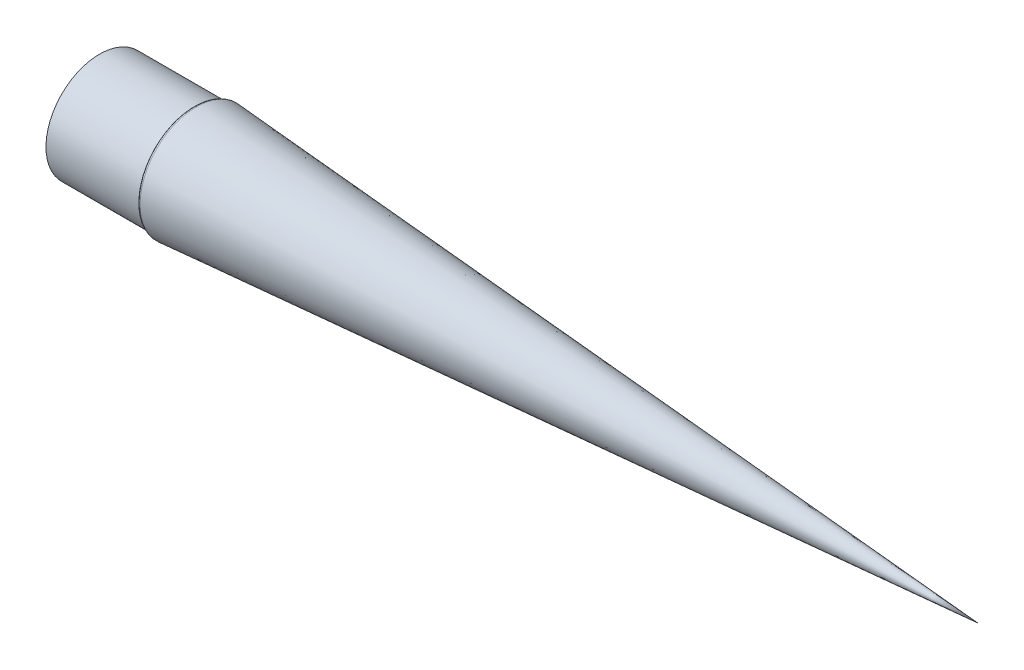
ISO-10303-21;
HEADER;
FILE_DESCRIPTION(('STEP AP214'),'2;1');
FILE_NAME('part.step','',(''),(''),'','','');
FILE_SCHEMA(('AUTOMOTIVE_DESIGN { 1 0 10303 214 1 1 1 1 }'));
ENDSEC;
DATA;
#1=APPLICATION_CONTEXT('core data for automotive mechanical design processes');
#2=APPLICATION_PROTOCOL_DEFINITION('international standard','automotive_design',2000,#1);
#3=PRODUCT_CONTEXT('',#1,'mechanical');
#4=PRODUCT('Part','Part','',(#3));
#5=PRODUCT_RELATED_PRODUCT_CATEGORY('part','',(#4));
#6=PRODUCT_DEFINITION_FORMATION('','',#4);
#7=PRODUCT_DEFINITION_CONTEXT('part definition',#1,'design');
#8=PRODUCT_DEFINITION('design','',#6,#7);
#9=PRODUCT_DEFINITION_SHAPE('','',#8);
#10=(LENGTH_UNIT() NAMED_UNIT(*) SI_UNIT(.MILLI.,.METRE.));
#11=(NAMED_UNIT(*) PLANE_ANGLE_UNIT() SI_UNIT($,.RADIAN.));
#12=(NAMED_UNIT(*) SI_UNIT($,.STERADIAN.) SOLID_ANGLE_UNIT());
#13=UNCERTAINTY_MEASURE_WITH_UNIT(LENGTH_MEASURE(1.E-05),#10,'distance_accuracy_value','');
#14=(GEOMETRIC_REPRESENTATION_CONTEXT(3) GLOBAL_UNCERTAINTY_ASSIGNED_CONTEXT((#13)) GLOBAL_UNIT_ASSIGNED_CONTEXT((#10,
#11,#12)) REPRESENTATION_CONTEXT('',''));
#15=CARTESIAN_POINT('',(0.,0.,0.));
#16=DIRECTION('',(0.,0.,1.));
#17=DIRECTION('',(1.,0.,0.));
#18=AXIS2_PLACEMENT_3D('',#15,#16,#17);
#19=CARTESIAN_POINT('',(-26.7776403853178,13.74,0.));
#20=DIRECTION('',(1.,0.,0.));
#21=DIRECTION('',(0.,1.,0.));
#22=AXIS2_PLACEMENT_3D('',#19,#20,#21);
#23=PLANE('',#22);
#24=CARTESIAN_POINT('',(-26.7776403853178,0.,0.));
#25=DIRECTION('',(-1.,0.,0.));
#26=DIRECTION('',(0.,-1.,0.));
#27=AXIS2_PLACEMENT_3D('',#24,#25,#26);
#28=CIRCLE('',#27,13.74);
#29=CARTESIAN_POINT('',(-26.7776403853178,-13.74,0.));
#30=VERTEX_POINT('',#29);
#31=EDGE_CURVE('E11',#30,#30,#28,.T.);
#32=ORIENTED_EDGE('',*,*,#31,.F.);
#33=EDGE_LOOP('',(#32));
#34=FACE_BOUND('',#33,.T.);
#35=CARTESIAN_POINT('',(-26.7776403853178,0.,0.));
#36=DIRECTION('',(-1.,0.,0.));
#37=DIRECTION('',(0.,-1.,0.));
#38=AXIS2_PLACEMENT_3D('',#35,#36,#37);
#39=CIRCLE('',#38,14.5);
#40=CARTESIAN_POINT('',(-26.7776403853178,-14.5,0.));
#41=VERTEX_POINT('',#40);
#42=EDGE_CURVE('E79',#41,#41,#39,.T.);
#43=ORIENTED_EDGE('',*,*,#42,.T.);
#44=EDGE_LOOP('',(#43));
#45=FACE_BOUND('',#44,.T.);
#46=ADVANCED_FACE('F33',(#34,#45),#23,.F.);
#47=CARTESIAN_POINT('',(0.,0.,0.));
#48=DIRECTION('',(-1.,0.,0.));
#49=DIRECTION('',(0.,-1.,0.));
#50=AXIS2_PLACEMENT_3D('',#47,#48,#49);
#51=CYLINDRICAL_SURFACE('',#50,13.74);
#52=CARTESIAN_POINT('',(-1.37764038531785,0.,0.));
#53=DIRECTION('',(-1.,0.,0.));
#54=DIRECTION('',(0.,-1.,0.));
#55=AXIS2_PLACEMENT_3D('',#52,#53,#54);
#56=CIRCLE('',#55,13.74);
#57=CARTESIAN_POINT('',(-1.37764038531784,-13.74,0.));
#58=VERTEX_POINT('',#57);
#59=EDGE_CURVE('E40',#58,#58,#56,.T.);
#60=ORIENTED_EDGE('',*,*,#59,.F.);
#61=EDGE_LOOP('',(#60));
#62=FACE_BOUND('',#61,.T.);
#63=ORIENTED_EDGE('',*,*,#31,.T.);
#64=EDGE_LOOP('',(#63));
#65=FACE_BOUND('',#64,.T.);
#66=ADVANCED_FACE('F70',(#62,#65),#51,.F.);
#67=CARTESIAN_POINT('',(-1.37764038531785,0.,0.));
#68=DIRECTION('',(-1.,0.,0.));
#69=DIRECTION('',(0.,-1.,0.));
#70=AXIS2_PLACEMENT_3D('',#67,#68,#69);
#71=TOROIDAL_SURFACE('',#70,14.5,0.76);
#72=CARTESIAN_POINT('',(-0.618623339422718,0.,0.));
#73=DIRECTION('',(-1.,0.,0.));
#74=DIRECTION('',(0.,-1.,0.));
#75=AXIS2_PLACEMENT_3D('',#72,#73,#74);
#76=CIRCLE('',#75,14.4613590367533);
#77=CARTESIAN_POINT('',(-0.618623339422717,-14.4613590367533,0.));
#78=VERTEX_POINT('',#77);
#79=EDGE_CURVE('E56',#78,#78,#76,.T.);
#80=ORIENTED_EDGE('',*,*,#79,.F.);
#81=EDGE_LOOP('',(#80));
#82=FACE_BOUND('',#81,.T.);
#83=ORIENTED_EDGE('',*,*,#59,.T.);
#84=EDGE_LOOP('',(#83));
#85=FACE_BOUND('',#84,.T.);
#86=ADVANCED_FACE('F68',(#82,#85),#71,.T.);
#87=CARTESIAN_POINT('',(-0.572578341392468,0.,0.));
#88=DIRECTION('',(-1.,0.,0.));
#89=DIRECTION('',(0.,-1.,0.));
#90=AXIS2_PLACEMENT_3D('',#87,#88,#89);
#91=TOROIDAL_SURFACE('',#90,14.459014921972,0.0461046279424731);
#92=CARTESIAN_POINT('',(-0.56926031238832,0.,0.));
#93=DIRECTION('',(-1.,0.,0.));
#94=DIRECTION('',(0.,-1.,0.));
#95=AXIS2_PLACEMENT_3D('',#92,#93,#94);
#96=CIRCLE('',#95,14.505);
#97=CARTESIAN_POINT('',(-0.569260312388319,-14.505,0.));
#98=VERTEX_POINT('',#97);
#99=EDGE_CURVE('E54',#98,#98,#96,.T.);
#100=ORIENTED_EDGE('',*,*,#99,.F.);
#101=EDGE_LOOP('',(#100));
#102=FACE_BOUND('',#101,.T.);
#103=ORIENTED_EDGE('',*,*,#79,.T.);
#104=EDGE_LOOP('',(#103));
#105=FACE_BOUND('',#104,.T.);
#106=ADVANCED_FACE('F50',(#102,#105),#91,.F.);
#107=CARTESIAN_POINT('',(-0.56926031238832,0.,0.));
#108=DIRECTION('',(-1.,0.,0.));
#109=DIRECTION('',(0.,-1.,0.));
#110=AXIS2_PLACEMENT_3D('',#107,#108,#109);
#111=CONICAL_SURFACE('',#110,14.505,0.0720296427488585);
#112=CARTESIAN_POINT('',(200.457781941133,0.,0.));
#113=VERTEX_POINT('',#112);
#114=VERTEX_LOOP('',#113);
#115=FACE_BOUND('',#114,.T.);
#116=ORIENTED_EDGE('',*,*,#99,.T.);
#117=EDGE_LOOP('',(#116));
#118=FACE_BOUND('',#117,.T.);
#119=ADVANCED_FACE('F46',(#115,#118),#111,.F.);
#120=CARTESIAN_POINT('',(211.018122792124,0.,0.));
#121=DIRECTION('',(-1.,0.,0.));
#122=DIRECTION('',(0.,-1.,0.));
#123=AXIS2_PLACEMENT_3D('',#120,#121,#122);
#124=CONICAL_SURFACE('',#123,0.,0.0720296427488585);
#125=CARTESIAN_POINT('',(-0.541877207875957,0.,0.));
#126=DIRECTION('',(-1.,0.,0.));
#127=DIRECTION('',(0.,-1.,0.));
#128=AXIS2_PLACEMENT_3D('',#125,#126,#127);
#129=CIRCLE('',#128,15.265);
#130=CARTESIAN_POINT('',(-0.541877207875956,-15.265,0.));
#131=VERTEX_POINT('',#130);
#132=EDGE_CURVE('E57',#131,#131,#129,.T.);
#133=ORIENTED_EDGE('',*,*,#132,.F.);
#134=EDGE_LOOP('',(#133));
#135=FACE_BOUND('',#134,.T.);
#136=CARTESIAN_POINT('',(211.018122792124,0.,0.));
#137=VERTEX_POINT('',#136);
#138=VERTEX_LOOP('',#137);
#139=FACE_BOUND('',#138,.T.);
#140=ADVANCED_FACE('F49',(#135,#139),#124,.T.);
#141=CARTESIAN_POINT('',(-0.591061621403481,0.,0.));
#142=DIRECTION('',(-1.,0.,0.));
#143=DIRECTION('',(0.,-1.,0.));
#144=AXIS2_PLACEMENT_3D('',#141,#142,#143);
#145=TOROIDAL_SURFACE('',#144,14.5833455928016,0.683426541324667);
#146=CARTESIAN_POINT('',(-1.2742659682536,0.,0.));
#147=DIRECTION('',(-1.,0.,0.));
#148=DIRECTION('',(0.,-1.,0.));
#149=AXIS2_PLACEMENT_3D('',#146,#147,#148);
#150=CIRCLE('',#149,14.6007713734756);
#151=CARTESIAN_POINT('',(-1.2742659682536,-14.6007713734756,0.));
#152=VERTEX_POINT('',#151);
#153=EDGE_CURVE('E62',#152,#152,#150,.T.);
#154=ORIENTED_EDGE('',*,*,#153,.F.);
#155=EDGE_LOOP('',(#154));
#156=FACE_BOUND('',#155,.T.);
#157=ORIENTED_EDGE('',*,*,#132,.T.);
#158=EDGE_LOOP('',(#157));
#159=FACE_BOUND('',#158,.T.);
#160=ADVANCED_FACE('F90',(#156,#159),#145,.T.);
#161=CARTESIAN_POINT('',(-1.37764038531785,0.,0.));
#162=DIRECTION('',(-1.,0.,0.));
#163=DIRECTION('',(0.,-1.,0.));
#164=AXIS2_PLACEMENT_3D('',#161,#162,#163);
#165=TOROIDAL_SURFACE('',#164,14.6034080369093,0.103408036909301);
#166=CARTESIAN_POINT('',(-1.37764038531785,0.,0.));
#167=DIRECTION('',(-1.,0.,0.));
#168=DIRECTION('',(0.,-1.,0.));
#169=AXIS2_PLACEMENT_3D('',#166,#167,#168);
#170=CIRCLE('',#169,14.5);
#171=CARTESIAN_POINT('',(-1.37764038531784,-14.5,0.));
#172=VERTEX_POINT('',#171);
#173=EDGE_CURVE('E81',#172,#172,#170,.T.);
#174=ORIENTED_EDGE('',*,*,#173,.F.);
#175=EDGE_LOOP('',(#174));
#176=FACE_BOUND('',#175,.T.);
#177=ORIENTED_EDGE('',*,*,#153,.T.);
#178=EDGE_LOOP('',(#177));
#179=FACE_BOUND('',#178,.T.);
#180=ADVANCED_FACE('F88',(#176,#179),#165,.F.);
#181=CARTESIAN_POINT('',(0.,0.,0.));
#182=DIRECTION('',(-1.,0.,0.));
#183=DIRECTION('',(0.,-1.,0.));
#184=AXIS2_PLACEMENT_3D('',#181,#182,#183);
#185=CYLINDRICAL_SURFACE('',#184,14.5);
#186=ORIENTED_EDGE('',*,*,#42,.F.);
#187=EDGE_LOOP('',(#186));
#188=FACE_BOUND('',#187,.T.);
#189=ORIENTED_EDGE('',*,*,#173,.T.);
#190=EDGE_LOOP('',(#189));
#191=FACE_BOUND('',#190,.T.);
#192=ADVANCED_FACE('F139',(#188,#191),#185,.T.);
#193=CLOSED_SHELL('',(#46,#66,#86,#106,#119,#140,#160,#180,#192));
#194=MANIFOLD_SOLID_BREP('B2',#193);
#195=ADVANCED_BREP_SHAPE_REPRESENTATION('',(#18,#194),#14);
#196=SHAPE_DEFINITION_REPRESENTATION(#9,#195);
ENDSEC;
END-ISO-10303-21;
